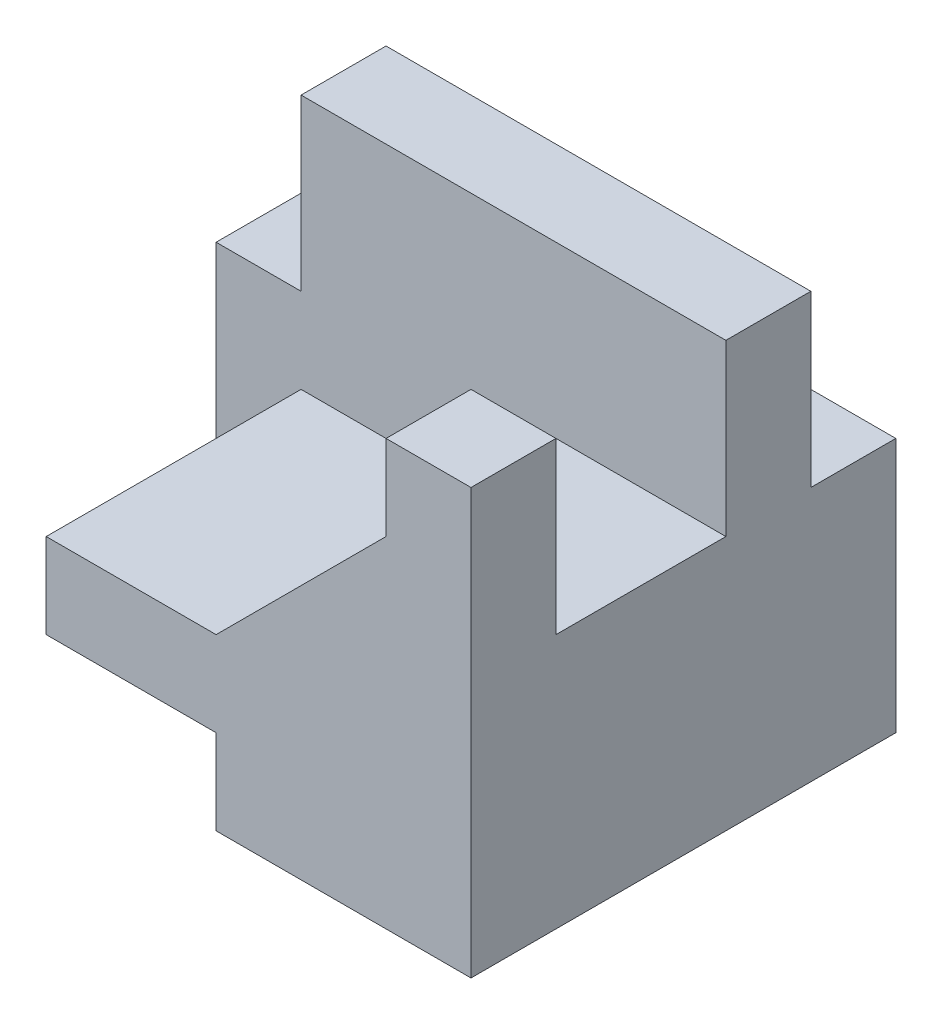
ISO-10303-21;
HEADER;
FILE_DESCRIPTION(('STEP AP214'),'2;1');
FILE_NAME('part.step','',(''),(''),'','','');
FILE_SCHEMA(('AUTOMOTIVE_DESIGN { 1 0 10303 214 1 1 1 1 }'));
ENDSEC;
DATA;
#1=APPLICATION_CONTEXT('core data for automotive mechanical design processes');
#2=APPLICATION_PROTOCOL_DEFINITION('international standard','automotive_design',2000,#1);
#3=PRODUCT_CONTEXT('',#1,'mechanical');
#4=PRODUCT('Part','Part','',(#3));
#5=PRODUCT_RELATED_PRODUCT_CATEGORY('part','',(#4));
#6=PRODUCT_DEFINITION_FORMATION('','',#4);
#7=PRODUCT_DEFINITION_CONTEXT('part definition',#1,'design');
#8=PRODUCT_DEFINITION('design','',#6,#7);
#9=PRODUCT_DEFINITION_SHAPE('','',#8);
#10=(LENGTH_UNIT() NAMED_UNIT(*) SI_UNIT(.MILLI.,.METRE.));
#11=(NAMED_UNIT(*) PLANE_ANGLE_UNIT() SI_UNIT($,.RADIAN.));
#12=(NAMED_UNIT(*) SI_UNIT($,.STERADIAN.) SOLID_ANGLE_UNIT());
#13=UNCERTAINTY_MEASURE_WITH_UNIT(LENGTH_MEASURE(1.E-05),#10,'distance_accuracy_value','');
#14=(GEOMETRIC_REPRESENTATION_CONTEXT(3) GLOBAL_UNCERTAINTY_ASSIGNED_CONTEXT((#13)) GLOBAL_UNIT_ASSIGNED_CONTEXT((#10,
#11,#12)) REPRESENTATION_CONTEXT('',''));
#15=CARTESIAN_POINT('',(0.,0.,0.));
#16=DIRECTION('',(0.,0.,1.));
#17=DIRECTION('',(1.,0.,0.));
#18=AXIS2_PLACEMENT_3D('',#15,#16,#17);
#19=CARTESIAN_POINT('',(15.,25.,15.));
#20=DIRECTION('',(0.,-1.,0.));
#21=DIRECTION('',(0.,0.,-1.));
#22=AXIS2_PLACEMENT_3D('',#19,#20,#21);
#23=PLANE('',#22);
#24=DIRECTION('',(1.,0.,0.));
#25=VECTOR('',#24,1.);
#26=CARTESIAN_POINT('',(15.,25.,0.));
#27=LINE('',#26,#25);
#28=CARTESIAN_POINT('',(-10.,25.,0.));
#29=VERTEX_POINT('',#28);
#30=CARTESIAN_POINT('',(15.,25.,0.));
#31=VERTEX_POINT('',#30);
#32=EDGE_CURVE('E152',#29,#31,#27,.T.);
#33=ORIENTED_EDGE('',*,*,#32,.T.);
#34=DIRECTION('',(0.,0.,-1.));
#35=VECTOR('',#34,1.);
#36=CARTESIAN_POINT('',(15.,25.,15.));
#37=LINE('',#36,#35);
#38=CARTESIAN_POINT('',(15.,25.,-5.));
#39=VERTEX_POINT('',#38);
#40=EDGE_CURVE('E156',#31,#39,#37,.T.);
#41=ORIENTED_EDGE('',*,*,#40,.T.);
#42=DIRECTION('',(-1.,0.,0.));
#43=VECTOR('',#42,1.);
#44=CARTESIAN_POINT('',(20.,25.,-5.));
#45=LINE('',#44,#43);
#46=CARTESIAN_POINT('',(-10.,25.,-5.));
#47=VERTEX_POINT('',#46);
#48=EDGE_CURVE('E207',#39,#47,#45,.T.);
#49=ORIENTED_EDGE('',*,*,#48,.T.);
#50=DIRECTION('',(0.,0.,1.));
#51=VECTOR('',#50,1.);
#52=CARTESIAN_POINT('',(-10.,25.,-15.));
#53=LINE('',#52,#51);
#54=EDGE_CURVE('E159',#47,#29,#53,.T.);
#55=ORIENTED_EDGE('',*,*,#54,.T.);
#56=EDGE_LOOP('',(#33,#41,#49,#55));
#57=FACE_BOUND('',#56,.T.);
#58=ADVANCED_FACE('F33',(#57),#23,.F.);
#59=CARTESIAN_POINT('',(0.,5.,15.));
#60=DIRECTION('',(1.,0.,0.));
#61=DIRECTION('',(0.,0.,-1.));
#62=AXIS2_PLACEMENT_3D('',#59,#60,#61);
#63=PLANE('',#62);
#64=DIRECTION('',(0.,-1.,0.));
#65=VECTOR('',#64,1.);
#66=CARTESIAN_POINT('',(0.,5.,0.));
#67=LINE('',#66,#65);
#68=CARTESIAN_POINT('',(0.,5.,0.));
#69=VERTEX_POINT('',#68);
#70=CARTESIAN_POINT('',(0.,0.,0.));
#71=VERTEX_POINT('',#70);
#72=EDGE_CURVE('E227',#69,#71,#67,.T.);
#73=ORIENTED_EDGE('',*,*,#72,.T.);
#74=DIRECTION('',(0.,0.,-1.));
#75=VECTOR('',#74,1.);
#76=CARTESIAN_POINT('',(0.,0.,15.));
#77=LINE('',#76,#75);
#78=CARTESIAN_POINT('',(0.,0.,15.));
#79=VERTEX_POINT('',#78);
#80=EDGE_CURVE('E191',#79,#71,#77,.T.);
#81=ORIENTED_EDGE('',*,*,#80,.F.);
#82=DIRECTION('',(0.,-1.,0.));
#83=VECTOR('',#82,1.);
#84=CARTESIAN_POINT('',(0.,5.,15.));
#85=LINE('',#84,#83);
#86=CARTESIAN_POINT('',(0.,5.,15.));
#87=VERTEX_POINT('',#86);
#88=EDGE_CURVE('E228',#87,#79,#85,.T.);
#89=ORIENTED_EDGE('',*,*,#88,.F.);
#90=DIRECTION('',(0.,0.,-1.));
#91=VECTOR('',#90,1.);
#92=CARTESIAN_POINT('',(0.,5.,15.));
#93=LINE('',#92,#91);
#94=EDGE_CURVE('E246',#87,#69,#93,.T.);
#95=ORIENTED_EDGE('',*,*,#94,.T.);
#96=EDGE_LOOP('',(#73,#81,#89,#95));
#97=FACE_BOUND('',#96,.T.);
#98=ADVANCED_FACE('F35',(#97),#63,.F.);
#99=CARTESIAN_POINT('',(0.,0.,15.));
#100=DIRECTION('',(0.,1.,0.));
#101=DIRECTION('',(0.,0.,1.));
#102=AXIS2_PLACEMENT_3D('',#99,#100,#101);
#103=PLANE('',#102);
#104=ORIENTED_EDGE('',*,*,#80,.T.);
#105=DIRECTION('',(-1.,0.,0.));
#106=VECTOR('',#105,1.);
#107=CARTESIAN_POINT('',(15.,0.,0.));
#108=LINE('',#107,#106);
#109=CARTESIAN_POINT('',(-15.,0.,0.));
#110=VERTEX_POINT('',#109);
#111=EDGE_CURVE('E221',#71,#110,#108,.T.);
#112=ORIENTED_EDGE('',*,*,#111,.T.);
#113=DIRECTION('',(0.,0.,1.));
#114=VECTOR('',#113,1.);
#115=CARTESIAN_POINT('',(-15.,0.,-10.));
#116=LINE('',#115,#114);
#117=CARTESIAN_POINT('',(-15.,0.,-10.));
#118=VERTEX_POINT('',#117);
#119=EDGE_CURVE('E220',#118,#110,#116,.T.);
#120=ORIENTED_EDGE('',*,*,#119,.F.);
#121=DIRECTION('',(-1.,0.,0.));
#122=VECTOR('',#121,1.);
#123=CARTESIAN_POINT('',(15.,0.,-10.));
#124=LINE('',#123,#122);
#125=CARTESIAN_POINT('',(15.,0.,-10.));
#126=VERTEX_POINT('',#125);
#127=EDGE_CURVE('E212',#126,#118,#124,.T.);
#128=ORIENTED_EDGE('',*,*,#127,.F.);
#129=DIRECTION('',(0.,0.,-1.));
#130=VECTOR('',#129,1.);
#131=CARTESIAN_POINT('',(15.,0.,15.));
#132=LINE('',#131,#130);
#133=CARTESIAN_POINT('',(15.,0.,15.));
#134=VERTEX_POINT('',#133);
#135=EDGE_CURVE('E183',#134,#126,#132,.T.);
#136=ORIENTED_EDGE('',*,*,#135,.F.);
#137=DIRECTION('',(1.,0.,0.));
#138=VECTOR('',#137,1.);
#139=CARTESIAN_POINT('',(0.,0.,15.));
#140=LINE('',#139,#138);
#141=EDGE_CURVE('E230',#79,#134,#140,.T.);
#142=ORIENTED_EDGE('',*,*,#141,.F.);
#143=EDGE_LOOP('',(#104,#112,#120,#128,#136,#142));
#144=FACE_BOUND('',#143,.T.);
#145=ADVANCED_FACE('F310',(#144),#103,.F.);
#146=CARTESIAN_POINT('',(15.,0.,15.));
#147=DIRECTION('',(-1.,0.,0.));
#148=DIRECTION('',(0.,0.,1.));
#149=AXIS2_PLACEMENT_3D('',#146,#147,#148);
#150=PLANE('',#149);
#151=ORIENTED_EDGE('',*,*,#40,.F.);
#152=DIRECTION('',(0.,-1.,0.));
#153=VECTOR('',#152,1.);
#154=CARTESIAN_POINT('',(15.,0.,0.));
#155=LINE('',#154,#153);
#156=CARTESIAN_POINT('',(15.,15.,0.));
#157=VERTEX_POINT('',#156);
#158=EDGE_CURVE('E167',#31,#157,#155,.T.);
#159=ORIENTED_EDGE('',*,*,#158,.T.);
#160=DIRECTION('',(0.,0.,1.));
#161=VECTOR('',#160,1.);
#162=CARTESIAN_POINT('',(15.,15.,15.));
#163=LINE('',#162,#161);
#164=CARTESIAN_POINT('',(15.,15.,10.));
#165=VERTEX_POINT('',#164);
#166=EDGE_CURVE('E284',#157,#165,#163,.T.);
#167=ORIENTED_EDGE('',*,*,#166,.T.);
#168=DIRECTION('',(0.,1.,0.));
#169=VECTOR('',#168,1.);
#170=CARTESIAN_POINT('',(15.,0.,10.));
#171=LINE('',#170,#169);
#172=CARTESIAN_POINT('',(15.,25.,10.));
#173=VERTEX_POINT('',#172);
#174=EDGE_CURVE('E283',#165,#173,#171,.T.);
#175=ORIENTED_EDGE('',*,*,#174,.T.);
#176=CARTESIAN_POINT('',(15.,25.,15.));
#177=VERTEX_POINT('',#176);
#178=EDGE_CURVE('E179',#177,#173,#37,.T.);
#179=ORIENTED_EDGE('',*,*,#178,.F.);
#180=DIRECTION('',(0.,1.,0.));
#181=VECTOR('',#180,1.);
#182=CARTESIAN_POINT('',(15.,0.,15.));
#183=LINE('',#182,#181);
#184=EDGE_CURVE('E233',#134,#177,#183,.T.);
#185=ORIENTED_EDGE('',*,*,#184,.F.);
#186=ORIENTED_EDGE('',*,*,#135,.T.);
#187=DIRECTION('',(0.,-1.,0.));
#188=VECTOR('',#187,1.);
#189=CARTESIAN_POINT('',(15.,0.,-10.));
#190=LINE('',#189,#188);
#191=CARTESIAN_POINT('',(15.,15.,-10.));
#192=VERTEX_POINT('',#191);
#193=EDGE_CURVE('E163',#192,#126,#190,.T.);
#194=ORIENTED_EDGE('',*,*,#193,.F.);
#195=DIRECTION('',(0.,0.,1.));
#196=VECTOR('',#195,1.);
#197=CARTESIAN_POINT('',(15.,15.,15.));
#198=LINE('',#197,#196);
#199=CARTESIAN_POINT('',(15.,15.,-5.));
#200=VERTEX_POINT('',#199);
#201=EDGE_CURVE('E203',#192,#200,#198,.T.);
#202=ORIENTED_EDGE('',*,*,#201,.T.);
#203=DIRECTION('',(0.,1.,0.));
#204=VECTOR('',#203,1.);
#205=CARTESIAN_POINT('',(15.,0.,-5.));
#206=LINE('',#205,#204);
#207=EDGE_CURVE('E178',#200,#39,#206,.T.);
#208=ORIENTED_EDGE('',*,*,#207,.T.);
#209=EDGE_LOOP('',(#151,#159,#167,#175,#179,#185,#186,#194,#202,#208));
#210=FACE_BOUND('',#209,.T.);
#211=ADVANCED_FACE('F176',(#210),#150,.F.);
#212=ORIENTED_EDGE('',*,*,#178,.T.);
#213=DIRECTION('',(-1.,0.,0.));
#214=VECTOR('',#213,1.);
#215=CARTESIAN_POINT('',(20.,25.,10.));
#216=LINE('',#215,#214);
#217=CARTESIAN_POINT('',(10.,25.,10.));
#218=VERTEX_POINT('',#217);
#219=EDGE_CURVE('E173',#173,#218,#216,.T.);
#220=ORIENTED_EDGE('',*,*,#219,.T.);
#221=DIRECTION('',(0.,0.,-1.));
#222=VECTOR('',#221,1.);
#223=CARTESIAN_POINT('',(10.,25.,15.));
#224=LINE('',#223,#222);
#225=CARTESIAN_POINT('',(10.,25.,15.));
#226=VERTEX_POINT('',#225);
#227=EDGE_CURVE('E180',#226,#218,#224,.T.);
#228=ORIENTED_EDGE('',*,*,#227,.F.);
#229=DIRECTION('',(-1.,0.,0.));
#230=VECTOR('',#229,1.);
#231=CARTESIAN_POINT('',(15.,25.,15.));
#232=LINE('',#231,#230);
#233=EDGE_CURVE('E235',#177,#226,#232,.T.);
#234=ORIENTED_EDGE('',*,*,#233,.F.);
#235=EDGE_LOOP('',(#212,#220,#228,#234));
#236=FACE_BOUND('',#235,.T.);
#237=ADVANCED_FACE('F321',(#236),#23,.F.);
#238=CARTESIAN_POINT('',(10.,25.,15.));
#239=DIRECTION('',(1.,0.,0.));
#240=DIRECTION('',(0.,0.,-1.));
#241=AXIS2_PLACEMENT_3D('',#238,#239,#240);
#242=PLANE('',#241);
#243=ORIENTED_EDGE('',*,*,#227,.T.);
#244=DIRECTION('',(0.,-1.,0.));
#245=VECTOR('',#244,1.);
#246=CARTESIAN_POINT('',(10.,25.,10.));
#247=LINE('',#246,#245);
#248=CARTESIAN_POINT('',(10.,20.,10.));
#249=VERTEX_POINT('',#248);
#250=EDGE_CURVE('E279',#218,#249,#247,.T.);
#251=ORIENTED_EDGE('',*,*,#250,.T.);
#252=DIRECTION('',(0.,0.,-1.));
#253=VECTOR('',#252,1.);
#254=CARTESIAN_POINT('',(10.,20.,15.));
#255=LINE('',#254,#253);
#256=CARTESIAN_POINT('',(10.,20.,15.));
#257=VERTEX_POINT('',#256);
#258=EDGE_CURVE('E185',#257,#249,#255,.T.);
#259=ORIENTED_EDGE('',*,*,#258,.F.);
#260=DIRECTION('',(0.,-1.,0.));
#261=VECTOR('',#260,1.);
#262=CARTESIAN_POINT('',(10.,25.,15.));
#263=LINE('',#262,#261);
#264=EDGE_CURVE('E237',#226,#257,#263,.T.);
#265=ORIENTED_EDGE('',*,*,#264,.F.);
#266=EDGE_LOOP('',(#243,#251,#259,#265));
#267=FACE_BOUND('',#266,.T.);
#268=ADVANCED_FACE('F278',(#267),#242,.F.);
#269=CARTESIAN_POINT('',(10.,20.,15.));
#270=DIRECTION('',(0.707106781186548,-0.707106781186547,0.));
#271=DIRECTION('',(0.707106781186547,0.707106781186548,0.));
#272=AXIS2_PLACEMENT_3D('',#269,#270,#271);
#273=PLANE('',#272);
#274=ORIENTED_EDGE('',*,*,#258,.T.);
#275=DIRECTION('',(-0.707106781186547,-0.707106781186548,0.));
#276=VECTOR('',#275,1.);
#277=CARTESIAN_POINT('',(10.,20.,10.));
#278=LINE('',#277,#276);
#279=CARTESIAN_POINT('',(5.,15.,10.));
#280=VERTEX_POINT('',#279);
#281=EDGE_CURVE('E11',#249,#280,#278,.T.);
#282=ORIENTED_EDGE('',*,*,#281,.T.);
#283=DIRECTION('',(0.,0.,-1.));
#284=VECTOR('',#283,1.);
#285=CARTESIAN_POINT('',(5.,15.,15.));
#286=LINE('',#285,#284);
#287=CARTESIAN_POINT('',(4.99999999999999,15.,0.));
#288=VERTEX_POINT('',#287);
#289=EDGE_CURVE('E172',#280,#288,#286,.T.);
#290=ORIENTED_EDGE('',*,*,#289,.T.);
#291=DIRECTION('',(-0.707106781186547,-0.707106781186548,0.));
#292=VECTOR('',#291,1.);
#293=CARTESIAN_POINT('',(10.,20.,0.));
#294=LINE('',#293,#292);
#295=CARTESIAN_POINT('',(0.,10.,0.));
#296=VERTEX_POINT('',#295);
#297=EDGE_CURVE('E249',#288,#296,#294,.T.);
#298=ORIENTED_EDGE('',*,*,#297,.T.);
#299=DIRECTION('',(0.,0.,-1.));
#300=VECTOR('',#299,1.);
#301=CARTESIAN_POINT('',(0.,10.,15.));
#302=LINE('',#301,#300);
#303=CARTESIAN_POINT('',(0.,10.,15.));
#304=VERTEX_POINT('',#303);
#305=EDGE_CURVE('E267',#304,#296,#302,.T.);
#306=ORIENTED_EDGE('',*,*,#305,.F.);
#307=DIRECTION('',(-0.707106781186547,-0.707106781186548,0.));
#308=VECTOR('',#307,1.);
#309=CARTESIAN_POINT('',(10.,20.,15.));
#310=LINE('',#309,#308);
#311=EDGE_CURVE('E239',#257,#304,#310,.T.);
#312=ORIENTED_EDGE('',*,*,#311,.F.);
#313=EDGE_LOOP('',(#274,#282,#290,#298,#306,#312));
#314=FACE_BOUND('',#313,.T.);
#315=ADVANCED_FACE('F273',(#314),#273,.F.);
#316=CARTESIAN_POINT('',(0.,10.,15.));
#317=DIRECTION('',(0.,-1.,0.));
#318=DIRECTION('',(1.,0.,0.));
#319=AXIS2_PLACEMENT_3D('',#316,#317,#318);
#320=PLANE('',#319);
#321=DIRECTION('',(-1.,0.,0.));
#322=VECTOR('',#321,1.);
#323=CARTESIAN_POINT('',(0.,10.,0.));
#324=LINE('',#323,#322);
#325=CARTESIAN_POINT('',(-10.,10.,0.));
#326=VERTEX_POINT('',#325);
#327=EDGE_CURVE('E251',#296,#326,#324,.T.);
#328=ORIENTED_EDGE('',*,*,#327,.T.);
#329=DIRECTION('',(0.,0.,-1.));
#330=VECTOR('',#329,1.);
#331=CARTESIAN_POINT('',(-10.,10.,15.));
#332=LINE('',#331,#330);
#333=CARTESIAN_POINT('',(-10.,10.,15.));
#334=VERTEX_POINT('',#333);
#335=EDGE_CURVE('E264',#334,#326,#332,.T.);
#336=ORIENTED_EDGE('',*,*,#335,.F.);
#337=DIRECTION('',(-1.,0.,0.));
#338=VECTOR('',#337,1.);
#339=CARTESIAN_POINT('',(0.,10.,15.));
#340=LINE('',#339,#338);
#341=EDGE_CURVE('E241',#304,#334,#340,.T.);
#342=ORIENTED_EDGE('',*,*,#341,.F.);
#343=ORIENTED_EDGE('',*,*,#305,.T.);
#344=EDGE_LOOP('',(#328,#336,#342,#343));
#345=FACE_BOUND('',#344,.T.);
#346=ADVANCED_FACE('F326',(#345),#320,.F.);
#347=CARTESIAN_POINT('',(-10.,10.,15.));
#348=DIRECTION('',(1.,0.,0.));
#349=DIRECTION('',(0.,1.,0.));
#350=AXIS2_PLACEMENT_3D('',#347,#348,#349);
#351=PLANE('',#350);
#352=DIRECTION('',(0.,-1.,0.));
#353=VECTOR('',#352,1.);
#354=CARTESIAN_POINT('',(-10.,10.,0.));
#355=LINE('',#354,#353);
#356=CARTESIAN_POINT('',(-10.,5.,0.));
#357=VERTEX_POINT('',#356);
#358=EDGE_CURVE('E254',#326,#357,#355,.T.);
#359=ORIENTED_EDGE('',*,*,#358,.T.);
#360=DIRECTION('',(0.,0.,-1.));
#361=VECTOR('',#360,1.);
#362=CARTESIAN_POINT('',(-10.,5.,15.));
#363=LINE('',#362,#361);
#364=CARTESIAN_POINT('',(-10.,5.,15.));
#365=VERTEX_POINT('',#364);
#366=EDGE_CURVE('E261',#365,#357,#363,.T.);
#367=ORIENTED_EDGE('',*,*,#366,.F.);
#368=DIRECTION('',(0.,-1.,0.));
#369=VECTOR('',#368,1.);
#370=CARTESIAN_POINT('',(-10.,10.,15.));
#371=LINE('',#370,#369);
#372=EDGE_CURVE('E243',#334,#365,#371,.T.);
#373=ORIENTED_EDGE('',*,*,#372,.F.);
#374=ORIENTED_EDGE('',*,*,#335,.T.);
#375=EDGE_LOOP('',(#359,#367,#373,#374));
#376=FACE_BOUND('',#375,.T.);
#377=ADVANCED_FACE('F329',(#376),#351,.F.);
#378=CARTESIAN_POINT('',(-10.,5.,15.));
#379=DIRECTION('',(0.,1.,0.));
#380=DIRECTION('',(0.,0.,1.));
#381=AXIS2_PLACEMENT_3D('',#378,#379,#380);
#382=PLANE('',#381);
#383=DIRECTION('',(1.,0.,0.));
#384=VECTOR('',#383,1.);
#385=CARTESIAN_POINT('',(-10.,5.,0.));
#386=LINE('',#385,#384);
#387=EDGE_CURVE('E231',#357,#69,#386,.T.);
#388=ORIENTED_EDGE('',*,*,#387,.T.);
#389=ORIENTED_EDGE('',*,*,#94,.F.);
#390=DIRECTION('',(1.,0.,0.));
#391=VECTOR('',#390,1.);
#392=CARTESIAN_POINT('',(-10.,5.,15.));
#393=LINE('',#392,#391);
#394=EDGE_CURVE('E56',#365,#87,#393,.T.);
#395=ORIENTED_EDGE('',*,*,#394,.F.);
#396=ORIENTED_EDGE('',*,*,#366,.T.);
#397=EDGE_LOOP('',(#388,#389,#395,#396));
#398=FACE_BOUND('',#397,.T.);
#399=ADVANCED_FACE('F314',(#398),#382,.F.);
#400=CARTESIAN_POINT('',(0.,0.,15.));
#401=DIRECTION('',(0.,0.,1.));
#402=DIRECTION('',(1.,0.,0.));
#403=AXIS2_PLACEMENT_3D('',#400,#401,#402);
#404=PLANE('',#403);
#405=ORIENTED_EDGE('',*,*,#88,.T.);
#406=ORIENTED_EDGE('',*,*,#141,.T.);
#407=ORIENTED_EDGE('',*,*,#184,.T.);
#408=ORIENTED_EDGE('',*,*,#233,.T.);
#409=ORIENTED_EDGE('',*,*,#264,.T.);
#410=ORIENTED_EDGE('',*,*,#311,.T.);
#411=ORIENTED_EDGE('',*,*,#341,.T.);
#412=ORIENTED_EDGE('',*,*,#372,.T.);
#413=ORIENTED_EDGE('',*,*,#394,.T.);
#414=EDGE_LOOP('',(#405,#406,#407,#408,#409,#410,#411,#412,#413));
#415=FACE_BOUND('',#414,.T.);
#416=ADVANCED_FACE('F317',(#415),#404,.T.);
#417=CARTESIAN_POINT('',(0.,0.,0.));
#418=DIRECTION('',(0.,0.,1.));
#419=DIRECTION('',(1.,0.,0.));
#420=AXIS2_PLACEMENT_3D('',#417,#418,#419);
#421=PLANE('',#420);
#422=ORIENTED_EDGE('',*,*,#297,.F.);
#423=DIRECTION('',(-1.,0.,0.));
#424=VECTOR('',#423,1.);
#425=CARTESIAN_POINT('',(20.,15.,0.));
#426=LINE('',#425,#424);
#427=EDGE_CURVE('E48',#157,#288,#426,.T.);
#428=ORIENTED_EDGE('',*,*,#427,.F.);
#429=ORIENTED_EDGE('',*,*,#158,.F.);
#430=ORIENTED_EDGE('',*,*,#32,.F.);
#431=DIRECTION('',(0.,1.,0.));
#432=VECTOR('',#431,1.);
#433=CARTESIAN_POINT('',(-10.,25.,0.));
#434=LINE('',#433,#432);
#435=CARTESIAN_POINT('',(-10.,15.,0.));
#436=VERTEX_POINT('',#435);
#437=EDGE_CURVE('E299',#436,#29,#434,.T.);
#438=ORIENTED_EDGE('',*,*,#437,.F.);
#439=DIRECTION('',(1.,0.,0.));
#440=VECTOR('',#439,1.);
#441=CARTESIAN_POINT('',(-15.,15.,0.));
#442=LINE('',#441,#440);
#443=CARTESIAN_POINT('',(-15.,15.,0.));
#444=VERTEX_POINT('',#443);
#445=EDGE_CURVE('E296',#444,#436,#442,.T.);
#446=ORIENTED_EDGE('',*,*,#445,.F.);
#447=DIRECTION('',(0.,1.,0.));
#448=VECTOR('',#447,1.);
#449=CARTESIAN_POINT('',(-15.,0.,0.));
#450=LINE('',#449,#448);
#451=EDGE_CURVE('E164',#110,#444,#450,.T.);
#452=ORIENTED_EDGE('',*,*,#451,.F.);
#453=ORIENTED_EDGE('',*,*,#111,.F.);
#454=ORIENTED_EDGE('',*,*,#72,.F.);
#455=ORIENTED_EDGE('',*,*,#387,.F.);
#456=ORIENTED_EDGE('',*,*,#358,.F.);
#457=ORIENTED_EDGE('',*,*,#327,.F.);
#458=EDGE_LOOP('',(#422,#428,#429,#430,#438,#446,#452,#453,#454,#455,#456,#457));
#459=FACE_BOUND('',#458,.T.);
#460=ADVANCED_FACE('F169',(#459),#421,.T.);
#461=CARTESIAN_POINT('',(-15.,0.,-10.));
#462=DIRECTION('',(1.,0.,0.));
#463=DIRECTION('',(0.,0.,-1.));
#464=AXIS2_PLACEMENT_3D('',#461,#462,#463);
#465=PLANE('',#464);
#466=ORIENTED_EDGE('',*,*,#451,.T.);
#467=DIRECTION('',(0.,0.,1.));
#468=VECTOR('',#467,1.);
#469=CARTESIAN_POINT('',(-15.,15.,-15.));
#470=LINE('',#469,#468);
#471=CARTESIAN_POINT('',(-15.,15.,-10.));
#472=VERTEX_POINT('',#471);
#473=EDGE_CURVE('E216',#472,#444,#470,.T.);
#474=ORIENTED_EDGE('',*,*,#473,.F.);
#475=DIRECTION('',(0.,1.,0.));
#476=VECTOR('',#475,1.);
#477=CARTESIAN_POINT('',(-15.,0.,-10.));
#478=LINE('',#477,#476);
#479=EDGE_CURVE('E199',#118,#472,#478,.T.);
#480=ORIENTED_EDGE('',*,*,#479,.F.);
#481=ORIENTED_EDGE('',*,*,#119,.T.);
#482=EDGE_LOOP('',(#466,#474,#480,#481));
#483=FACE_BOUND('',#482,.T.);
#484=ADVANCED_FACE('F307',(#483),#465,.F.);
#485=CARTESIAN_POINT('',(0.,0.,-10.));
#486=DIRECTION('',(0.,0.,1.));
#487=DIRECTION('',(1.,0.,0.));
#488=AXIS2_PLACEMENT_3D('',#485,#486,#487);
#489=PLANE('',#488);
#490=DIRECTION('',(1.,0.,0.));
#491=VECTOR('',#490,1.);
#492=CARTESIAN_POINT('',(0.,15.,-10.));
#493=LINE('',#492,#491);
#494=EDGE_CURVE('E41',#472,#192,#493,.T.);
#495=ORIENTED_EDGE('',*,*,#494,.T.);
#496=ORIENTED_EDGE('',*,*,#193,.T.);
#497=ORIENTED_EDGE('',*,*,#127,.T.);
#498=ORIENTED_EDGE('',*,*,#479,.T.);
#499=EDGE_LOOP('',(#495,#496,#497,#498));
#500=FACE_BOUND('',#499,.T.);
#501=ADVANCED_FACE('F196',(#500),#489,.F.);
#502=CARTESIAN_POINT('',(-10.,25.,-15.));
#503=DIRECTION('',(1.,0.,0.));
#504=DIRECTION('',(0.,0.,-1.));
#505=AXIS2_PLACEMENT_3D('',#502,#503,#504);
#506=PLANE('',#505);
#507=ORIENTED_EDGE('',*,*,#54,.F.);
#508=DIRECTION('',(0.,1.,0.));
#509=VECTOR('',#508,1.);
#510=CARTESIAN_POINT('',(-10.,15.,-5.));
#511=LINE('',#510,#509);
#512=CARTESIAN_POINT('',(-10.,15.,-5.));
#513=VERTEX_POINT('',#512);
#514=EDGE_CURVE('E287',#513,#47,#511,.T.);
#515=ORIENTED_EDGE('',*,*,#514,.F.);
#516=DIRECTION('',(0.,0.,1.));
#517=VECTOR('',#516,1.);
#518=CARTESIAN_POINT('',(-10.,15.,-15.));
#519=LINE('',#518,#517);
#520=EDGE_CURVE('E301',#513,#436,#519,.T.);
#521=ORIENTED_EDGE('',*,*,#520,.T.);
#522=ORIENTED_EDGE('',*,*,#437,.T.);
#523=EDGE_LOOP('',(#507,#515,#521,#522));
#524=FACE_BOUND('',#523,.T.);
#525=ADVANCED_FACE('F394',(#524),#506,.F.);
#526=CARTESIAN_POINT('',(-15.,15.,-15.));
#527=DIRECTION('',(0.,-1.,0.));
#528=DIRECTION('',(0.,0.,-1.));
#529=AXIS2_PLACEMENT_3D('',#526,#527,#528);
#530=PLANE('',#529);
#531=ORIENTED_EDGE('',*,*,#473,.T.);
#532=ORIENTED_EDGE('',*,*,#445,.T.);
#533=ORIENTED_EDGE('',*,*,#520,.F.);
#534=DIRECTION('',(-1.,0.,0.));
#535=VECTOR('',#534,1.);
#536=CARTESIAN_POINT('',(20.,15.,-5.));
#537=LINE('',#536,#535);
#538=EDGE_CURVE('E206',#200,#513,#537,.T.);
#539=ORIENTED_EDGE('',*,*,#538,.F.);
#540=ORIENTED_EDGE('',*,*,#201,.F.);
#541=ORIENTED_EDGE('',*,*,#494,.F.);
#542=EDGE_LOOP('',(#531,#532,#533,#539,#540,#541));
#543=FACE_BOUND('',#542,.T.);
#544=ADVANCED_FACE('F204',(#543),#530,.F.);
#545=CARTESIAN_POINT('',(20.,15.,-5.));
#546=DIRECTION('',(0.,0.,1.));
#547=DIRECTION('',(1.,0.,0.));
#548=AXIS2_PLACEMENT_3D('',#545,#546,#547);
#549=PLANE('',#548);
#550=ORIENTED_EDGE('',*,*,#538,.T.);
#551=ORIENTED_EDGE('',*,*,#514,.T.);
#552=ORIENTED_EDGE('',*,*,#48,.F.);
#553=ORIENTED_EDGE('',*,*,#207,.F.);
#554=EDGE_LOOP('',(#550,#551,#552,#553));
#555=FACE_BOUND('',#554,.T.);
#556=ADVANCED_FACE('F407',(#555),#549,.F.);
#557=CARTESIAN_POINT('',(20.,25.,10.));
#558=DIRECTION('',(0.,0.,1.));
#559=DIRECTION('',(0.,-1.,0.));
#560=AXIS2_PLACEMENT_3D('',#557,#558,#559);
#561=PLANE('',#560);
#562=DIRECTION('',(-1.,0.,0.));
#563=VECTOR('',#562,1.);
#564=CARTESIAN_POINT('',(20.,15.,10.));
#565=LINE('',#564,#563);
#566=EDGE_CURVE('E504',#165,#280,#565,.T.);
#567=ORIENTED_EDGE('',*,*,#566,.T.);
#568=ORIENTED_EDGE('',*,*,#281,.F.);
#569=ORIENTED_EDGE('',*,*,#250,.F.);
#570=ORIENTED_EDGE('',*,*,#219,.F.);
#571=ORIENTED_EDGE('',*,*,#174,.F.);
#572=EDGE_LOOP('',(#567,#568,#569,#570,#571));
#573=FACE_BOUND('',#572,.T.);
#574=ADVANCED_FACE('F414',(#573),#561,.F.);
#575=CARTESIAN_POINT('',(20.,15.,0.));
#576=DIRECTION('',(0.,-1.,0.));
#577=DIRECTION('',(0.,0.,-1.));
#578=AXIS2_PLACEMENT_3D('',#575,#576,#577);
#579=PLANE('',#578);
#580=ORIENTED_EDGE('',*,*,#427,.T.);
#581=ORIENTED_EDGE('',*,*,#289,.F.);
#582=ORIENTED_EDGE('',*,*,#566,.F.);
#583=ORIENTED_EDGE('',*,*,#166,.F.);
#584=EDGE_LOOP('',(#580,#581,#582,#583));
#585=FACE_BOUND('',#584,.T.);
#586=ADVANCED_FACE('F421',(#585),#579,.F.);
#587=CLOSED_SHELL('',(#58,#98,#145,#211,#237,#268,#315,#346,#377,#399,#416,#460,#484,#501,#525,
#544,#556,#574,#586));
#588=MANIFOLD_SOLID_BREP('B2',#587);
#589=ADVANCED_BREP_SHAPE_REPRESENTATION('',(#18,#588),#14);
#590=SHAPE_DEFINITION_REPRESENTATION(#9,#589);
ENDSEC;
END-ISO-10303-21;
